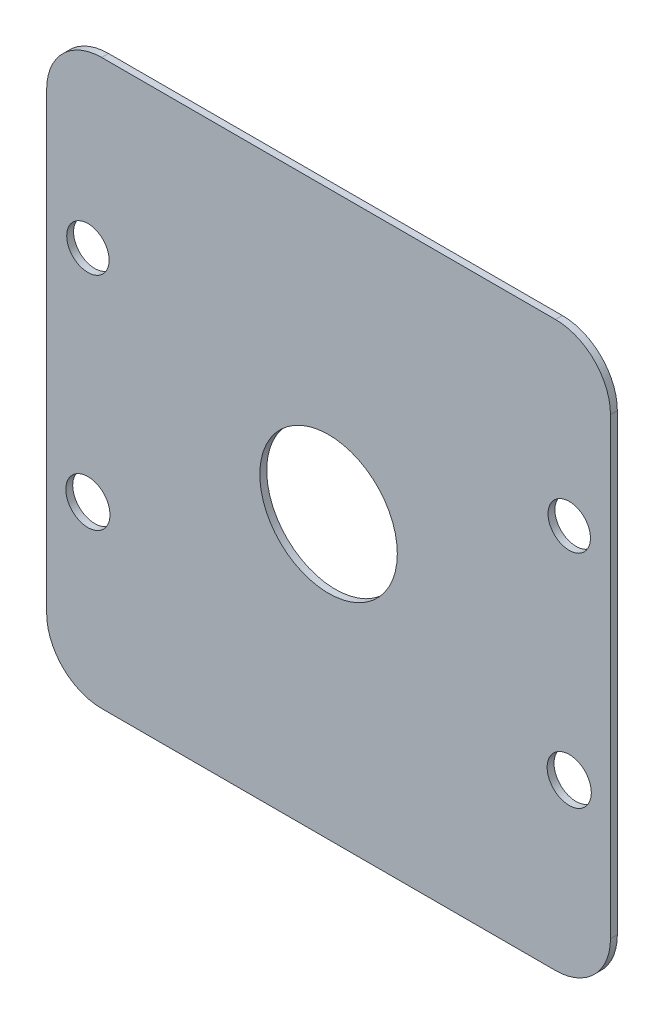
ISO-10303-21;
HEADER;
FILE_DESCRIPTION(('STEP AP214'),'2;1');
FILE_NAME('part.step','',(''),(''),'','','');
FILE_SCHEMA(('AUTOMOTIVE_DESIGN { 1 0 10303 214 1 1 1 1 }'));
ENDSEC;
DATA;
#1=APPLICATION_CONTEXT('core data for automotive mechanical design processes');
#2=APPLICATION_PROTOCOL_DEFINITION('international standard','automotive_design',2000,#1);
#3=PRODUCT_CONTEXT('',#1,'mechanical');
#4=PRODUCT('Part','Part','',(#3));
#5=PRODUCT_RELATED_PRODUCT_CATEGORY('part','',(#4));
#6=PRODUCT_DEFINITION_FORMATION('','',#4);
#7=PRODUCT_DEFINITION_CONTEXT('part definition',#1,'design');
#8=PRODUCT_DEFINITION('design','',#6,#7);
#9=PRODUCT_DEFINITION_SHAPE('','',#8);
#10=(LENGTH_UNIT() NAMED_UNIT(*) SI_UNIT(.MILLI.,.METRE.));
#11=(NAMED_UNIT(*) PLANE_ANGLE_UNIT() SI_UNIT($,.RADIAN.));
#12=(NAMED_UNIT(*) SI_UNIT($,.STERADIAN.) SOLID_ANGLE_UNIT());
#13=UNCERTAINTY_MEASURE_WITH_UNIT(LENGTH_MEASURE(1.E-05),#10,'distance_accuracy_value','');
#14=(GEOMETRIC_REPRESENTATION_CONTEXT(3) GLOBAL_UNCERTAINTY_ASSIGNED_CONTEXT((#13)) GLOBAL_UNIT_ASSIGNED_CONTEXT((#10,
#11,#12)) REPRESENTATION_CONTEXT('',''));
#15=CARTESIAN_POINT('',(0.,0.,0.));
#16=DIRECTION('',(0.,0.,1.));
#17=DIRECTION('',(1.,0.,0.));
#18=AXIS2_PLACEMENT_3D('',#15,#16,#17);
#19=CARTESIAN_POINT('',(-16.5,-16.5,0.5));
#20=DIRECTION('',(0.,0.,1.));
#21=DIRECTION('',(1.,0.,0.));
#22=AXIS2_PLACEMENT_3D('',#19,#20,#21);
#23=PLANE('',#22);
#24=CARTESIAN_POINT('',(-17.5,8.,0.5));
#25=DIRECTION('',(0.,0.,1.));
#26=DIRECTION('',(-1.,0.,0.));
#27=AXIS2_PLACEMENT_3D('',#24,#25,#26);
#28=CIRCLE('',#27,1.54161113738979);
#29=CARTESIAN_POINT('',(-19.0416111373898,8.,0.5));
#30=VERTEX_POINT('',#29);
#31=EDGE_CURVE('E196',#30,#30,#28,.T.);
#32=ORIENTED_EDGE('',*,*,#31,.F.);
#33=EDGE_LOOP('',(#32));
#34=FACE_BOUND('',#33,.T.);
#35=CARTESIAN_POINT('',(17.5,-8.,0.5));
#36=DIRECTION('',(0.,0.,1.));
#37=DIRECTION('',(1.,0.,0.));
#38=AXIS2_PLACEMENT_3D('',#35,#36,#37);
#39=CIRCLE('',#38,1.60610727163314);
#40=CARTESIAN_POINT('',(19.1061072716331,-8.,0.5));
#41=VERTEX_POINT('',#40);
#42=EDGE_CURVE('E184',#41,#41,#39,.T.);
#43=ORIENTED_EDGE('',*,*,#42,.F.);
#44=EDGE_LOOP('',(#43));
#45=FACE_BOUND('',#44,.T.);
#46=CARTESIAN_POINT('',(-16.5,-16.5,0.5));
#47=DIRECTION('',(0.,0.,1.));
#48=DIRECTION('',(1.,0.,0.));
#49=AXIS2_PLACEMENT_3D('',#46,#47,#48);
#50=CIRCLE('',#49,4.);
#51=CARTESIAN_POINT('',(-20.5,-16.5,0.5));
#52=VERTEX_POINT('',#51);
#53=CARTESIAN_POINT('',(-16.5,-20.5,0.5));
#54=VERTEX_POINT('',#53);
#55=EDGE_CURVE('E147',#52,#54,#50,.T.);
#56=ORIENTED_EDGE('',*,*,#55,.T.);
#57=DIRECTION('',(1.,0.,0.));
#58=VECTOR('',#57,1.);
#59=CARTESIAN_POINT('',(-16.5,-20.5,0.5));
#60=LINE('',#59,#58);
#61=CARTESIAN_POINT('',(16.5,-20.5,0.5));
#62=VERTEX_POINT('',#61);
#63=EDGE_CURVE('E95',#54,#62,#60,.T.);
#64=ORIENTED_EDGE('',*,*,#63,.T.);
#65=CARTESIAN_POINT('',(16.5,-16.5,0.5));
#66=DIRECTION('',(0.,0.,1.));
#67=DIRECTION('',(1.,0.,0.));
#68=AXIS2_PLACEMENT_3D('',#65,#66,#67);
#69=CIRCLE('',#68,4.);
#70=CARTESIAN_POINT('',(20.5,-16.5,0.5));
#71=VERTEX_POINT('',#70);
#72=EDGE_CURVE('E162',#62,#71,#69,.T.);
#73=ORIENTED_EDGE('',*,*,#72,.T.);
#74=DIRECTION('',(0.,1.,0.));
#75=VECTOR('',#74,1.);
#76=CARTESIAN_POINT('',(20.5,-16.5,0.5));
#77=LINE('',#76,#75);
#78=CARTESIAN_POINT('',(20.5,16.5,0.5));
#79=VERTEX_POINT('',#78);
#80=EDGE_CURVE('E175',#71,#79,#77,.T.);
#81=ORIENTED_EDGE('',*,*,#80,.T.);
#82=CARTESIAN_POINT('',(16.5,16.5,0.5));
#83=DIRECTION('',(0.,0.,1.));
#84=DIRECTION('',(1.,0.,0.));
#85=AXIS2_PLACEMENT_3D('',#82,#83,#84);
#86=CIRCLE('',#85,4.);
#87=CARTESIAN_POINT('',(16.5,20.5,0.5));
#88=VERTEX_POINT('',#87);
#89=EDGE_CURVE('E114',#79,#88,#86,.T.);
#90=ORIENTED_EDGE('',*,*,#89,.T.);
#91=DIRECTION('',(-1.,0.,0.));
#92=VECTOR('',#91,1.);
#93=CARTESIAN_POINT('',(-16.5,20.5,0.5));
#94=LINE('',#93,#92);
#95=CARTESIAN_POINT('',(-16.5,20.5,0.5));
#96=VERTEX_POINT('',#95);
#97=EDGE_CURVE('E108',#88,#96,#94,.T.);
#98=ORIENTED_EDGE('',*,*,#97,.T.);
#99=CARTESIAN_POINT('',(-16.5,16.5,0.5));
#100=DIRECTION('',(0.,0.,1.));
#101=DIRECTION('',(-1.,0.,0.));
#102=AXIS2_PLACEMENT_3D('',#99,#100,#101);
#103=CIRCLE('',#102,4.);
#104=CARTESIAN_POINT('',(-20.5,16.5,0.5));
#105=VERTEX_POINT('',#104);
#106=EDGE_CURVE('E112',#96,#105,#103,.T.);
#107=ORIENTED_EDGE('',*,*,#106,.T.);
#108=DIRECTION('',(0.,-1.,0.));
#109=VECTOR('',#108,1.);
#110=CARTESIAN_POINT('',(-20.5,-16.5,0.5));
#111=LINE('',#110,#109);
#112=EDGE_CURVE('E52',#105,#52,#111,.T.);
#113=ORIENTED_EDGE('',*,*,#112,.T.);
#114=EDGE_LOOP('',(#56,#64,#73,#81,#90,#98,#107,#113));
#115=FACE_BOUND('',#114,.T.);
#116=CARTESIAN_POINT('',(0.,0.,0.5));
#117=DIRECTION('',(0.,0.,1.));
#118=DIRECTION('',(1.,0.,0.));
#119=AXIS2_PLACEMENT_3D('',#116,#117,#118);
#120=CIRCLE('',#119,5.);
#121=CARTESIAN_POINT('',(5.,0.,0.5));
#122=VERTEX_POINT('',#121);
#123=EDGE_CURVE('E136',#122,#122,#120,.T.);
#124=ORIENTED_EDGE('',*,*,#123,.F.);
#125=EDGE_LOOP('',(#124));
#126=FACE_BOUND('',#125,.T.);
#127=CARTESIAN_POINT('',(17.5,8.,0.5));
#128=DIRECTION('',(0.,0.,1.));
#129=DIRECTION('',(1.,0.,0.));
#130=AXIS2_PLACEMENT_3D('',#127,#128,#129);
#131=CIRCLE('',#130,1.54161113738979);
#132=CARTESIAN_POINT('',(19.0416111373898,8.,0.5));
#133=VERTEX_POINT('',#132);
#134=EDGE_CURVE('E190',#133,#133,#131,.T.);
#135=ORIENTED_EDGE('',*,*,#134,.F.);
#136=EDGE_LOOP('',(#135));
#137=FACE_BOUND('',#136,.T.);
#138=CARTESIAN_POINT('',(-17.5,-8.,0.5));
#139=DIRECTION('',(0.,0.,1.));
#140=DIRECTION('',(-1.,0.,0.));
#141=AXIS2_PLACEMENT_3D('',#138,#139,#140);
#142=CIRCLE('',#141,1.60610727163314);
#143=CARTESIAN_POINT('',(-19.1061072716331,-8.,0.5));
#144=VERTEX_POINT('',#143);
#145=EDGE_CURVE('E202',#144,#144,#142,.T.);
#146=ORIENTED_EDGE('',*,*,#145,.F.);
#147=EDGE_LOOP('',(#146));
#148=FACE_BOUND('',#147,.T.);
#149=ADVANCED_FACE('F35',(#34,#45,#115,#126,#137,#148),#23,.T.);
#150=CARTESIAN_POINT('',(-16.5,-16.5,0.));
#151=DIRECTION('',(0.,0.,1.));
#152=DIRECTION('',(1.,0.,0.));
#153=AXIS2_PLACEMENT_3D('',#150,#151,#152);
#154=PLANE('',#153);
#155=CARTESIAN_POINT('',(-17.5,8.,0.));
#156=DIRECTION('',(0.,0.,1.));
#157=DIRECTION('',(-1.,0.,0.));
#158=AXIS2_PLACEMENT_3D('',#155,#156,#157);
#159=CIRCLE('',#158,1.54161113738979);
#160=CARTESIAN_POINT('',(-19.0416111373898,8.,0.));
#161=VERTEX_POINT('',#160);
#162=EDGE_CURVE('E199',#161,#161,#159,.T.);
#163=ORIENTED_EDGE('',*,*,#162,.T.);
#164=EDGE_LOOP('',(#163));
#165=FACE_BOUND('',#164,.T.);
#166=CARTESIAN_POINT('',(17.5,-8.,0.));
#167=DIRECTION('',(0.,0.,1.));
#168=DIRECTION('',(1.,0.,0.));
#169=AXIS2_PLACEMENT_3D('',#166,#167,#168);
#170=CIRCLE('',#169,1.60610727163314);
#171=CARTESIAN_POINT('',(19.1061072716331,-8.,0.));
#172=VERTEX_POINT('',#171);
#173=EDGE_CURVE('E187',#172,#172,#170,.T.);
#174=ORIENTED_EDGE('',*,*,#173,.T.);
#175=EDGE_LOOP('',(#174));
#176=FACE_BOUND('',#175,.T.);
#177=CARTESIAN_POINT('',(-16.5,-16.5,0.));
#178=DIRECTION('',(0.,0.,1.));
#179=DIRECTION('',(1.,0.,0.));
#180=AXIS2_PLACEMENT_3D('',#177,#178,#179);
#181=CIRCLE('',#180,4.);
#182=CARTESIAN_POINT('',(-20.5,-16.5,0.));
#183=VERTEX_POINT('',#182);
#184=CARTESIAN_POINT('',(-16.5,-20.5,0.));
#185=VERTEX_POINT('',#184);
#186=EDGE_CURVE('E132',#183,#185,#181,.T.);
#187=ORIENTED_EDGE('',*,*,#186,.F.);
#188=DIRECTION('',(0.,-1.,0.));
#189=VECTOR('',#188,1.);
#190=CARTESIAN_POINT('',(-20.5,-16.5,0.));
#191=LINE('',#190,#189);
#192=CARTESIAN_POINT('',(-20.5,16.5,0.));
#193=VERTEX_POINT('',#192);
#194=EDGE_CURVE('E87',#193,#183,#191,.T.);
#195=ORIENTED_EDGE('',*,*,#194,.F.);
#196=CARTESIAN_POINT('',(-16.5,16.5,0.));
#197=DIRECTION('',(0.,0.,1.));
#198=DIRECTION('',(-1.,0.,0.));
#199=AXIS2_PLACEMENT_3D('',#196,#197,#198);
#200=CIRCLE('',#199,4.);
#201=CARTESIAN_POINT('',(-16.5,20.5,0.));
#202=VERTEX_POINT('',#201);
#203=EDGE_CURVE('E81',#202,#193,#200,.T.);
#204=ORIENTED_EDGE('',*,*,#203,.F.);
#205=DIRECTION('',(-1.,0.,0.));
#206=VECTOR('',#205,1.);
#207=CARTESIAN_POINT('',(-16.5,20.5,0.));
#208=LINE('',#207,#206);
#209=CARTESIAN_POINT('',(16.5,20.5,0.));
#210=VERTEX_POINT('',#209);
#211=EDGE_CURVE('E122',#210,#202,#208,.T.);
#212=ORIENTED_EDGE('',*,*,#211,.F.);
#213=CARTESIAN_POINT('',(16.5,16.5,0.));
#214=DIRECTION('',(0.,0.,1.));
#215=DIRECTION('',(1.,0.,0.));
#216=AXIS2_PLACEMENT_3D('',#213,#214,#215);
#217=CIRCLE('',#216,4.);
#218=CARTESIAN_POINT('',(20.5,16.5,0.));
#219=VERTEX_POINT('',#218);
#220=EDGE_CURVE('E142',#219,#210,#217,.T.);
#221=ORIENTED_EDGE('',*,*,#220,.F.);
#222=DIRECTION('',(0.,1.,0.));
#223=VECTOR('',#222,1.);
#224=CARTESIAN_POINT('',(20.5,-16.5,0.));
#225=LINE('',#224,#223);
#226=CARTESIAN_POINT('',(20.5,-16.5,0.));
#227=VERTEX_POINT('',#226);
#228=EDGE_CURVE('E140',#227,#219,#225,.T.);
#229=ORIENTED_EDGE('',*,*,#228,.F.);
#230=CARTESIAN_POINT('',(16.5,-16.5,0.));
#231=DIRECTION('',(0.,0.,1.));
#232=DIRECTION('',(1.,0.,0.));
#233=AXIS2_PLACEMENT_3D('',#230,#231,#232);
#234=CIRCLE('',#233,4.);
#235=CARTESIAN_POINT('',(16.5,-20.5,0.));
#236=VERTEX_POINT('',#235);
#237=EDGE_CURVE('E138',#236,#227,#234,.T.);
#238=ORIENTED_EDGE('',*,*,#237,.F.);
#239=DIRECTION('',(1.,0.,0.));
#240=VECTOR('',#239,1.);
#241=CARTESIAN_POINT('',(-16.5,-20.5,0.));
#242=LINE('',#241,#240);
#243=EDGE_CURVE('E135',#185,#236,#242,.T.);
#244=ORIENTED_EDGE('',*,*,#243,.F.);
#245=EDGE_LOOP('',(#187,#195,#204,#212,#221,#229,#238,#244));
#246=FACE_BOUND('',#245,.T.);
#247=CARTESIAN_POINT('',(0.,0.,0.));
#248=DIRECTION('',(0.,0.,1.));
#249=DIRECTION('',(1.,0.,0.));
#250=AXIS2_PLACEMENT_3D('',#247,#248,#249);
#251=CIRCLE('',#250,5.);
#252=CARTESIAN_POINT('',(5.,0.,0.));
#253=VERTEX_POINT('',#252);
#254=EDGE_CURVE('E181',#253,#253,#251,.T.);
#255=ORIENTED_EDGE('',*,*,#254,.T.);
#256=EDGE_LOOP('',(#255));
#257=FACE_BOUND('',#256,.T.);
#258=CARTESIAN_POINT('',(17.5,8.,0.));
#259=DIRECTION('',(0.,0.,1.));
#260=DIRECTION('',(1.,0.,0.));
#261=AXIS2_PLACEMENT_3D('',#258,#259,#260);
#262=CIRCLE('',#261,1.54161113738979);
#263=CARTESIAN_POINT('',(19.0416111373898,8.,0.));
#264=VERTEX_POINT('',#263);
#265=EDGE_CURVE('E193',#264,#264,#262,.T.);
#266=ORIENTED_EDGE('',*,*,#265,.T.);
#267=EDGE_LOOP('',(#266));
#268=FACE_BOUND('',#267,.T.);
#269=CARTESIAN_POINT('',(-17.5,-8.,0.));
#270=DIRECTION('',(0.,0.,1.));
#271=DIRECTION('',(-1.,0.,0.));
#272=AXIS2_PLACEMENT_3D('',#269,#270,#271);
#273=CIRCLE('',#272,1.60610727163314);
#274=CARTESIAN_POINT('',(-19.1061072716331,-8.,0.));
#275=VERTEX_POINT('',#274);
#276=EDGE_CURVE('E205',#275,#275,#273,.T.);
#277=ORIENTED_EDGE('',*,*,#276,.T.);
#278=EDGE_LOOP('',(#277));
#279=FACE_BOUND('',#278,.T.);
#280=ADVANCED_FACE('F166',(#165,#176,#246,#257,#268,#279),#154,.F.);
#281=CARTESIAN_POINT('',(-16.5,-16.5,0.5));
#282=DIRECTION('',(0.,0.,-1.));
#283=DIRECTION('',(-1.,0.,0.));
#284=AXIS2_PLACEMENT_3D('',#281,#282,#283);
#285=CYLINDRICAL_SURFACE('',#284,4.);
#286=ORIENTED_EDGE('',*,*,#186,.T.);
#287=DIRECTION('',(0.,0.,-1.));
#288=VECTOR('',#287,1.);
#289=CARTESIAN_POINT('',(-16.5,-20.5,0.5));
#290=LINE('',#289,#288);
#291=EDGE_CURVE('E11',#54,#185,#290,.T.);
#292=ORIENTED_EDGE('',*,*,#291,.F.);
#293=ORIENTED_EDGE('',*,*,#55,.F.);
#294=DIRECTION('',(0.,0.,-1.));
#295=VECTOR('',#294,1.);
#296=CARTESIAN_POINT('',(-20.5,-16.5,0.5));
#297=LINE('',#296,#295);
#298=EDGE_CURVE('E128',#52,#183,#297,.T.);
#299=ORIENTED_EDGE('',*,*,#298,.T.);
#300=EDGE_LOOP('',(#286,#292,#293,#299));
#301=FACE_BOUND('',#300,.T.);
#302=ADVANCED_FACE('F37',(#301),#285,.T.);
#303=CARTESIAN_POINT('',(-16.5,-20.5,0.5));
#304=DIRECTION('',(0.,1.,0.));
#305=DIRECTION('',(0.,0.,1.));
#306=AXIS2_PLACEMENT_3D('',#303,#304,#305);
#307=PLANE('',#306);
#308=ORIENTED_EDGE('',*,*,#243,.T.);
#309=DIRECTION('',(0.,0.,-1.));
#310=VECTOR('',#309,1.);
#311=CARTESIAN_POINT('',(16.5,-20.5,0.5));
#312=LINE('',#311,#310);
#313=EDGE_CURVE('E44',#62,#236,#312,.T.);
#314=ORIENTED_EDGE('',*,*,#313,.F.);
#315=ORIENTED_EDGE('',*,*,#63,.F.);
#316=ORIENTED_EDGE('',*,*,#291,.T.);
#317=EDGE_LOOP('',(#308,#314,#315,#316));
#318=FACE_BOUND('',#317,.T.);
#319=ADVANCED_FACE('F240',(#318),#307,.F.);
#320=CARTESIAN_POINT('',(16.5,-16.5,0.5));
#321=DIRECTION('',(0.,0.,-1.));
#322=DIRECTION('',(-1.,0.,0.));
#323=AXIS2_PLACEMENT_3D('',#320,#321,#322);
#324=CYLINDRICAL_SURFACE('',#323,4.);
#325=ORIENTED_EDGE('',*,*,#237,.T.);
#326=DIRECTION('',(0.,0.,-1.));
#327=VECTOR('',#326,1.);
#328=CARTESIAN_POINT('',(20.5,-16.5,0.5));
#329=LINE('',#328,#327);
#330=EDGE_CURVE('E154',#71,#227,#329,.T.);
#331=ORIENTED_EDGE('',*,*,#330,.F.);
#332=ORIENTED_EDGE('',*,*,#72,.F.);
#333=ORIENTED_EDGE('',*,*,#313,.T.);
#334=EDGE_LOOP('',(#325,#331,#332,#333));
#335=FACE_BOUND('',#334,.T.);
#336=ADVANCED_FACE('F160',(#335),#324,.T.);
#337=CARTESIAN_POINT('',(20.5,-16.5,0.5));
#338=DIRECTION('',(-1.,0.,0.));
#339=DIRECTION('',(0.,0.,1.));
#340=AXIS2_PLACEMENT_3D('',#337,#338,#339);
#341=PLANE('',#340);
#342=ORIENTED_EDGE('',*,*,#228,.T.);
#343=DIRECTION('',(0.,0.,-1.));
#344=VECTOR('',#343,1.);
#345=CARTESIAN_POINT('',(20.5,16.5,0.5));
#346=LINE('',#345,#344);
#347=EDGE_CURVE('E151',#79,#219,#346,.T.);
#348=ORIENTED_EDGE('',*,*,#347,.F.);
#349=ORIENTED_EDGE('',*,*,#80,.F.);
#350=ORIENTED_EDGE('',*,*,#330,.T.);
#351=EDGE_LOOP('',(#342,#348,#349,#350));
#352=FACE_BOUND('',#351,.T.);
#353=ADVANCED_FACE('F171',(#352),#341,.F.);
#354=CARTESIAN_POINT('',(16.5,16.5,0.5));
#355=DIRECTION('',(0.,0.,-1.));
#356=DIRECTION('',(-1.,0.,0.));
#357=AXIS2_PLACEMENT_3D('',#354,#355,#356);
#358=CYLINDRICAL_SURFACE('',#357,4.);
#359=ORIENTED_EDGE('',*,*,#220,.T.);
#360=DIRECTION('',(0.,0.,-1.));
#361=VECTOR('',#360,1.);
#362=CARTESIAN_POINT('',(16.5,20.5,0.5));
#363=LINE('',#362,#361);
#364=EDGE_CURVE('E123',#88,#210,#363,.T.);
#365=ORIENTED_EDGE('',*,*,#364,.F.);
#366=ORIENTED_EDGE('',*,*,#89,.F.);
#367=ORIENTED_EDGE('',*,*,#347,.T.);
#368=EDGE_LOOP('',(#359,#365,#366,#367));
#369=FACE_BOUND('',#368,.T.);
#370=ADVANCED_FACE('F174',(#369),#358,.T.);
#371=CARTESIAN_POINT('',(-16.5,20.5,0.5));
#372=DIRECTION('',(0.,-1.,0.));
#373=DIRECTION('',(0.,0.,-1.));
#374=AXIS2_PLACEMENT_3D('',#371,#372,#373);
#375=PLANE('',#374);
#376=ORIENTED_EDGE('',*,*,#211,.T.);
#377=DIRECTION('',(0.,0.,-1.));
#378=VECTOR('',#377,1.);
#379=CARTESIAN_POINT('',(-16.5,20.5,0.5));
#380=LINE('',#379,#378);
#381=EDGE_CURVE('E119',#96,#202,#380,.T.);
#382=ORIENTED_EDGE('',*,*,#381,.F.);
#383=ORIENTED_EDGE('',*,*,#97,.F.);
#384=ORIENTED_EDGE('',*,*,#364,.T.);
#385=EDGE_LOOP('',(#376,#382,#383,#384));
#386=FACE_BOUND('',#385,.T.);
#387=ADVANCED_FACE('F120',(#386),#375,.F.);
#388=CARTESIAN_POINT('',(-16.5,16.5,0.5));
#389=DIRECTION('',(0.,0.,-1.));
#390=DIRECTION('',(-1.,0.,0.));
#391=AXIS2_PLACEMENT_3D('',#388,#389,#390);
#392=CYLINDRICAL_SURFACE('',#391,4.);
#393=ORIENTED_EDGE('',*,*,#203,.T.);
#394=DIRECTION('',(0.,0.,-1.));
#395=VECTOR('',#394,1.);
#396=CARTESIAN_POINT('',(-20.5,16.5,0.5));
#397=LINE('',#396,#395);
#398=EDGE_CURVE('E124',#105,#193,#397,.T.);
#399=ORIENTED_EDGE('',*,*,#398,.F.);
#400=ORIENTED_EDGE('',*,*,#106,.F.);
#401=ORIENTED_EDGE('',*,*,#381,.T.);
#402=EDGE_LOOP('',(#393,#399,#400,#401));
#403=FACE_BOUND('',#402,.T.);
#404=ADVANCED_FACE('F126',(#403),#392,.T.);
#405=CARTESIAN_POINT('',(-20.5,-16.5,0.5));
#406=DIRECTION('',(1.,0.,0.));
#407=DIRECTION('',(0.,0.,-1.));
#408=AXIS2_PLACEMENT_3D('',#405,#406,#407);
#409=PLANE('',#408);
#410=ORIENTED_EDGE('',*,*,#194,.T.);
#411=ORIENTED_EDGE('',*,*,#298,.F.);
#412=ORIENTED_EDGE('',*,*,#112,.F.);
#413=ORIENTED_EDGE('',*,*,#398,.T.);
#414=EDGE_LOOP('',(#410,#411,#412,#413));
#415=FACE_BOUND('',#414,.T.);
#416=ADVANCED_FACE('F228',(#415),#409,.F.);
#417=CARTESIAN_POINT('',(0.,0.,0.5));
#418=DIRECTION('',(0.,0.,-1.));
#419=DIRECTION('',(-1.,0.,0.));
#420=AXIS2_PLACEMENT_3D('',#417,#418,#419);
#421=CYLINDRICAL_SURFACE('',#420,5.);
#422=ORIENTED_EDGE('',*,*,#123,.T.);
#423=EDGE_LOOP('',(#422));
#424=FACE_BOUND('',#423,.T.);
#425=ORIENTED_EDGE('',*,*,#254,.F.);
#426=EDGE_LOOP('',(#425));
#427=FACE_BOUND('',#426,.T.);
#428=ADVANCED_FACE('F225',(#424,#427),#421,.F.);
#429=CARTESIAN_POINT('',(17.5,-8.,0.5));
#430=DIRECTION('',(0.,0.,-1.));
#431=DIRECTION('',(-1.,0.,0.));
#432=AXIS2_PLACEMENT_3D('',#429,#430,#431);
#433=CYLINDRICAL_SURFACE('',#432,1.60610727163314);
#434=ORIENTED_EDGE('',*,*,#42,.T.);
#435=EDGE_LOOP('',(#434));
#436=FACE_BOUND('',#435,.T.);
#437=ORIENTED_EDGE('',*,*,#173,.F.);
#438=EDGE_LOOP('',(#437));
#439=FACE_BOUND('',#438,.T.);
#440=ADVANCED_FACE('F304',(#436,#439),#433,.F.);
#441=CARTESIAN_POINT('',(17.5,8.,0.5));
#442=DIRECTION('',(0.,0.,-1.));
#443=DIRECTION('',(-1.,0.,0.));
#444=AXIS2_PLACEMENT_3D('',#441,#442,#443);
#445=CYLINDRICAL_SURFACE('',#444,1.54161113738979);
#446=ORIENTED_EDGE('',*,*,#134,.T.);
#447=EDGE_LOOP('',(#446));
#448=FACE_BOUND('',#447,.T.);
#449=ORIENTED_EDGE('',*,*,#265,.F.);
#450=EDGE_LOOP('',(#449));
#451=FACE_BOUND('',#450,.T.);
#452=ADVANCED_FACE('F313',(#448,#451),#445,.F.);
#453=CARTESIAN_POINT('',(-17.5,8.,0.5));
#454=DIRECTION('',(0.,0.,-1.));
#455=DIRECTION('',(-1.,0.,0.));
#456=AXIS2_PLACEMENT_3D('',#453,#454,#455);
#457=CYLINDRICAL_SURFACE('',#456,1.54161113738979);
#458=ORIENTED_EDGE('',*,*,#31,.T.);
#459=EDGE_LOOP('',(#458));
#460=FACE_BOUND('',#459,.T.);
#461=ORIENTED_EDGE('',*,*,#162,.F.);
#462=EDGE_LOOP('',(#461));
#463=FACE_BOUND('',#462,.T.);
#464=ADVANCED_FACE('F321',(#460,#463),#457,.F.);
#465=CARTESIAN_POINT('',(-17.5,-8.,0.5));
#466=DIRECTION('',(0.,0.,-1.));
#467=DIRECTION('',(-1.,0.,0.));
#468=AXIS2_PLACEMENT_3D('',#465,#466,#467);
#469=CYLINDRICAL_SURFACE('',#468,1.60610727163314);
#470=ORIENTED_EDGE('',*,*,#145,.T.);
#471=EDGE_LOOP('',(#470));
#472=FACE_BOUND('',#471,.T.);
#473=ORIENTED_EDGE('',*,*,#276,.F.);
#474=EDGE_LOOP('',(#473));
#475=FACE_BOUND('',#474,.T.);
#476=ADVANCED_FACE('F211',(#472,#475),#469,.F.);
#477=CLOSED_SHELL('',(#149,#280,#302,#319,#336,#353,#370,#387,#404,#416,#428,#440,#452,#464,#476));
#478=MANIFOLD_SOLID_BREP('B2',#477);
#479=ADVANCED_BREP_SHAPE_REPRESENTATION('',(#18,#478),#14);
#480=SHAPE_DEFINITION_REPRESENTATION(#9,#479);
ENDSEC;
END-ISO-10303-21;
